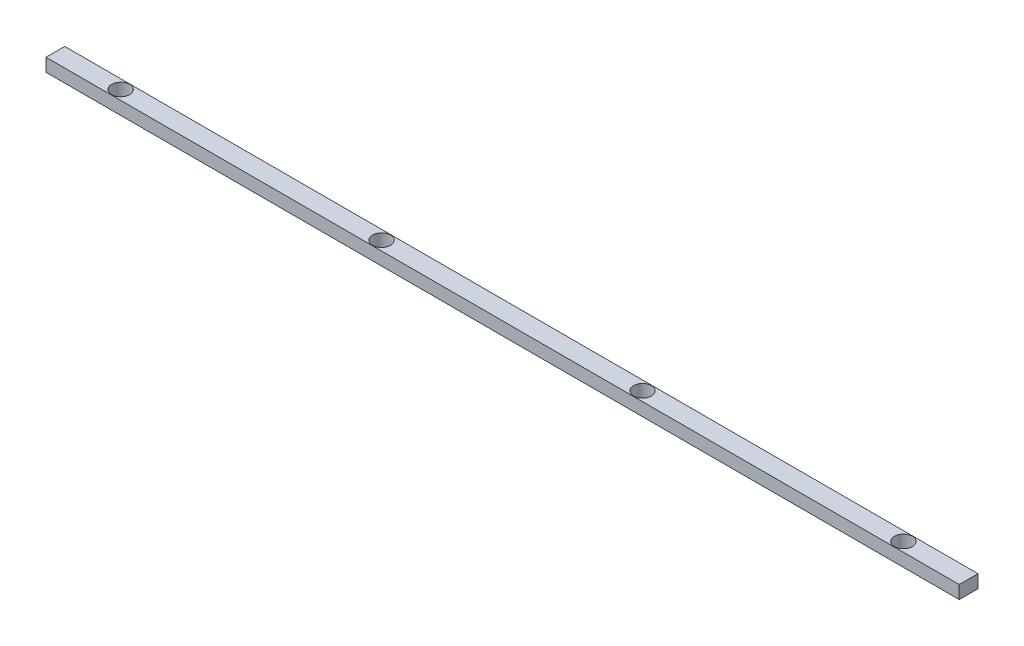
ISO-10303-21;
HEADER;
FILE_DESCRIPTION(('STEP AP214'),'2;1');
FILE_NAME('part.step','',(''),(''),'','','');
FILE_SCHEMA(('AUTOMOTIVE_DESIGN { 1 0 10303 214 1 1 1 1 }'));
ENDSEC;
DATA;
#1=APPLICATION_CONTEXT('core data for automotive mechanical design processes');
#2=APPLICATION_PROTOCOL_DEFINITION('international standard','automotive_design',2000,#1);
#3=PRODUCT_CONTEXT('',#1,'mechanical');
#4=PRODUCT('Part','Part','',(#3));
#5=PRODUCT_RELATED_PRODUCT_CATEGORY('part','',(#4));
#6=PRODUCT_DEFINITION_FORMATION('','',#4);
#7=PRODUCT_DEFINITION_CONTEXT('part definition',#1,'design');
#8=PRODUCT_DEFINITION('design','',#6,#7);
#9=PRODUCT_DEFINITION_SHAPE('','',#8);
#10=(LENGTH_UNIT() NAMED_UNIT(*) SI_UNIT(.MILLI.,.METRE.));
#11=(NAMED_UNIT(*) PLANE_ANGLE_UNIT() SI_UNIT($,.RADIAN.));
#12=(NAMED_UNIT(*) SI_UNIT($,.STERADIAN.) SOLID_ANGLE_UNIT());
#13=UNCERTAINTY_MEASURE_WITH_UNIT(LENGTH_MEASURE(1.E-05),#10,'distance_accuracy_value','');
#14=(GEOMETRIC_REPRESENTATION_CONTEXT(3) GLOBAL_UNCERTAINTY_ASSIGNED_CONTEXT((#13)) GLOBAL_UNIT_ASSIGNED_CONTEXT((#10,
#11,#12)) REPRESENTATION_CONTEXT('',''));
#15=CARTESIAN_POINT('',(0.,0.,0.));
#16=DIRECTION('',(0.,0.,1.));
#17=DIRECTION('',(1.,0.,0.));
#18=AXIS2_PLACEMENT_3D('',#15,#16,#17);
#19=CARTESIAN_POINT('',(177.799999999999,5.08,3.65124999999998));
#20=DIRECTION('',(-1.,0.,0.));
#21=DIRECTION('',(0.,0.,1.));
#22=AXIS2_PLACEMENT_3D('',#19,#20,#21);
#23=PLANE('',#22);
#24=DIRECTION('',(0.,0.,-1.));
#25=VECTOR('',#24,1.);
#26=CARTESIAN_POINT('',(177.799999999999,0.,3.65124999999998));
#27=LINE('',#26,#25);
#28=CARTESIAN_POINT('',(177.799999999999,0.,3.65124999999998));
#29=VERTEX_POINT('',#28);
#30=CARTESIAN_POINT('',(177.799999999999,0.,-3.65125000000004));
#31=VERTEX_POINT('',#30);
#32=EDGE_CURVE('E96',#29,#31,#27,.T.);
#33=ORIENTED_EDGE('',*,*,#32,.T.);
#34=DIRECTION('',(0.,-1.,0.));
#35=VECTOR('',#34,1.);
#36=CARTESIAN_POINT('',(177.799999999999,5.08,-3.65125000000004));
#37=LINE('',#36,#35);
#38=CARTESIAN_POINT('',(177.799999999999,5.08,-3.65125000000004));
#39=VERTEX_POINT('',#38);
#40=EDGE_CURVE('E11',#39,#31,#37,.T.);
#41=ORIENTED_EDGE('',*,*,#40,.F.);
#42=DIRECTION('',(0.,0.,-1.));
#43=VECTOR('',#42,1.);
#44=CARTESIAN_POINT('',(177.799999999999,5.08,3.65124999999998));
#45=LINE('',#44,#43);
#46=CARTESIAN_POINT('',(177.799999999999,5.08,3.65124999999998));
#47=VERTEX_POINT('',#46);
#48=EDGE_CURVE('E84',#47,#39,#45,.T.);
#49=ORIENTED_EDGE('',*,*,#48,.F.);
#50=DIRECTION('',(0.,-1.,0.));
#51=VECTOR('',#50,1.);
#52=CARTESIAN_POINT('',(177.799999999999,5.08,3.65124999999998));
#53=LINE('',#52,#51);
#54=EDGE_CURVE('E92',#47,#29,#53,.T.);
#55=ORIENTED_EDGE('',*,*,#54,.T.);
#56=EDGE_LOOP('',(#33,#41,#49,#55));
#57=FACE_BOUND('',#56,.T.);
#58=ADVANCED_FACE('F33',(#57),#23,.F.);
#59=CARTESIAN_POINT('',(-177.800000000001,5.08,-3.65125000000004));
#60=DIRECTION('',(0.,0.,1.));
#61=DIRECTION('',(1.,0.,0.));
#62=AXIS2_PLACEMENT_3D('',#59,#60,#61);
#63=PLANE('',#62);
#64=DIRECTION('',(-1.,0.,0.));
#65=VECTOR('',#64,1.);
#66=CARTESIAN_POINT('',(-177.800000000001,0.,-3.65125000000004));
#67=LINE('',#66,#65);
#68=CARTESIAN_POINT('',(-177.800000000001,0.,-3.65125000000004));
#69=VERTEX_POINT('',#68);
#70=EDGE_CURVE('E88',#31,#69,#67,.T.);
#71=ORIENTED_EDGE('',*,*,#70,.T.);
#72=DIRECTION('',(0.,-1.,0.));
#73=VECTOR('',#72,1.);
#74=CARTESIAN_POINT('',(-177.800000000001,5.08,-3.65125000000004));
#75=LINE('',#74,#73);
#76=CARTESIAN_POINT('',(-177.800000000001,5.08,-3.65125000000004));
#77=VERTEX_POINT('',#76);
#78=EDGE_CURVE('E41',#77,#69,#75,.T.);
#79=ORIENTED_EDGE('',*,*,#78,.F.);
#80=DIRECTION('',(-1.,0.,0.));
#81=VECTOR('',#80,1.);
#82=CARTESIAN_POINT('',(-177.800000000001,5.08,-3.65125000000004));
#83=LINE('',#82,#81);
#84=EDGE_CURVE('E79',#39,#77,#83,.T.);
#85=ORIENTED_EDGE('',*,*,#84,.F.);
#86=ORIENTED_EDGE('',*,*,#40,.T.);
#87=EDGE_LOOP('',(#71,#79,#85,#86));
#88=FACE_BOUND('',#87,.T.);
#89=ADVANCED_FACE('F87',(#88),#63,.F.);
#90=CARTESIAN_POINT('',(-177.800000000001,5.08,3.65124999999998));
#91=DIRECTION('',(1.,0.,0.));
#92=DIRECTION('',(0.,0.,-1.));
#93=AXIS2_PLACEMENT_3D('',#90,#91,#92);
#94=PLANE('',#93);
#95=DIRECTION('',(0.,0.,1.));
#96=VECTOR('',#95,1.);
#97=CARTESIAN_POINT('',(-177.800000000001,0.,3.65124999999998));
#98=LINE('',#97,#96);
#99=CARTESIAN_POINT('',(-177.800000000001,0.,3.65124999999998));
#100=VERTEX_POINT('',#99);
#101=EDGE_CURVE('E66',#69,#100,#98,.T.);
#102=ORIENTED_EDGE('',*,*,#101,.T.);
#103=DIRECTION('',(0.,-1.,0.));
#104=VECTOR('',#103,1.);
#105=CARTESIAN_POINT('',(-177.800000000001,5.08,3.65124999999998));
#106=LINE('',#105,#104);
#107=CARTESIAN_POINT('',(-177.800000000001,5.08,3.65124999999998));
#108=VERTEX_POINT('',#107);
#109=EDGE_CURVE('E89',#108,#100,#106,.T.);
#110=ORIENTED_EDGE('',*,*,#109,.F.);
#111=DIRECTION('',(0.,0.,1.));
#112=VECTOR('',#111,1.);
#113=CARTESIAN_POINT('',(-177.800000000001,5.08,3.65124999999998));
#114=LINE('',#113,#112);
#115=EDGE_CURVE('E82',#77,#108,#114,.T.);
#116=ORIENTED_EDGE('',*,*,#115,.F.);
#117=ORIENTED_EDGE('',*,*,#78,.T.);
#118=EDGE_LOOP('',(#102,#110,#116,#117));
#119=FACE_BOUND('',#118,.T.);
#120=ADVANCED_FACE('F90',(#119),#94,.F.);
#121=CARTESIAN_POINT('',(-177.800000000001,5.08,3.65124999999998));
#122=DIRECTION('',(0.,0.,-1.));
#123=DIRECTION('',(-1.,0.,0.));
#124=AXIS2_PLACEMENT_3D('',#121,#122,#123);
#125=PLANE('',#124);
#126=DIRECTION('',(1.,0.,0.));
#127=VECTOR('',#126,1.);
#128=CARTESIAN_POINT('',(-177.800000000001,0.,3.65124999999998));
#129=LINE('',#128,#127);
#130=EDGE_CURVE('E72',#100,#29,#129,.T.);
#131=ORIENTED_EDGE('',*,*,#130,.T.);
#132=ORIENTED_EDGE('',*,*,#54,.F.);
#133=DIRECTION('',(1.,0.,0.));
#134=VECTOR('',#133,1.);
#135=CARTESIAN_POINT('',(-177.800000000001,5.08,3.65124999999998));
#136=LINE('',#135,#134);
#137=EDGE_CURVE('E49',#108,#47,#136,.T.);
#138=ORIENTED_EDGE('',*,*,#137,.F.);
#139=ORIENTED_EDGE('',*,*,#109,.T.);
#140=EDGE_LOOP('',(#131,#132,#138,#139));
#141=FACE_BOUND('',#140,.T.);
#142=ADVANCED_FACE('F104',(#141),#125,.F.);
#143=CARTESIAN_POINT('',(0.,5.08,0.));
#144=DIRECTION('',(0.,-1.,0.));
#145=DIRECTION('',(0.,0.,-1.));
#146=AXIS2_PLACEMENT_3D('',#143,#144,#145);
#147=PLANE('',#146);
#148=CARTESIAN_POINT('',(152.399999999999,5.08,0.));
#149=DIRECTION('',(0.,1.,0.));
#150=DIRECTION('',(0.,0.,1.));
#151=AXIS2_PLACEMENT_3D('',#148,#149,#150);
#152=CIRCLE('',#151,3.49250000000001);
#153=CARTESIAN_POINT('',(152.399999999999,5.08,3.49250000000001));
#154=VERTEX_POINT('',#153);
#155=EDGE_CURVE('E128',#154,#154,#152,.T.);
#156=ORIENTED_EDGE('',*,*,#155,.F.);
#157=EDGE_LOOP('',(#156));
#158=FACE_BOUND('',#157,.T.);
#159=CARTESIAN_POINT('',(50.7999999999987,5.08,0.));
#160=DIRECTION('',(0.,1.,0.));
#161=DIRECTION('',(0.,0.,1.));
#162=AXIS2_PLACEMENT_3D('',#159,#160,#161);
#163=CIRCLE('',#162,3.49250000000001);
#164=CARTESIAN_POINT('',(50.7999999999987,5.08,3.49250000000001));
#165=VERTEX_POINT('',#164);
#166=EDGE_CURVE('E122',#165,#165,#163,.T.);
#167=ORIENTED_EDGE('',*,*,#166,.F.);
#168=EDGE_LOOP('',(#167));
#169=FACE_BOUND('',#168,.T.);
#170=CARTESIAN_POINT('',(-50.8000000000013,5.08,0.));
#171=DIRECTION('',(0.,1.,0.));
#172=DIRECTION('',(0.,0.,1.));
#173=AXIS2_PLACEMENT_3D('',#170,#171,#172);
#174=CIRCLE('',#173,3.49250000000001);
#175=CARTESIAN_POINT('',(-50.8000000000013,5.08,3.49250000000001));
#176=VERTEX_POINT('',#175);
#177=EDGE_CURVE('E116',#176,#176,#174,.T.);
#178=ORIENTED_EDGE('',*,*,#177,.F.);
#179=EDGE_LOOP('',(#178));
#180=FACE_BOUND('',#179,.T.);
#181=CARTESIAN_POINT('',(-152.400000000001,5.08,0.));
#182=DIRECTION('',(0.,1.,0.));
#183=DIRECTION('',(0.,0.,1.));
#184=AXIS2_PLACEMENT_3D('',#181,#182,#183);
#185=CIRCLE('',#184,3.49250000000001);
#186=CARTESIAN_POINT('',(-152.400000000001,5.08,3.49250000000001));
#187=VERTEX_POINT('',#186);
#188=EDGE_CURVE('E110',#187,#187,#185,.T.);
#189=ORIENTED_EDGE('',*,*,#188,.F.);
#190=EDGE_LOOP('',(#189));
#191=FACE_BOUND('',#190,.T.);
#192=ORIENTED_EDGE('',*,*,#48,.T.);
#193=ORIENTED_EDGE('',*,*,#84,.T.);
#194=ORIENTED_EDGE('',*,*,#115,.T.);
#195=ORIENTED_EDGE('',*,*,#137,.T.);
#196=EDGE_LOOP('',(#192,#193,#194,#195));
#197=FACE_BOUND('',#196,.T.);
#198=ADVANCED_FACE('F80',(#158,#169,#180,#191,#197),#147,.F.);
#199=CARTESIAN_POINT('',(0.,0.,0.));
#200=DIRECTION('',(0.,-1.,0.));
#201=DIRECTION('',(0.,0.,-1.));
#202=AXIS2_PLACEMENT_3D('',#199,#200,#201);
#203=PLANE('',#202);
#204=CARTESIAN_POINT('',(152.399999999999,0.,0.));
#205=DIRECTION('',(0.,1.,0.));
#206=DIRECTION('',(0.,0.,1.));
#207=AXIS2_PLACEMENT_3D('',#204,#205,#206);
#208=CIRCLE('',#207,3.49250000000001);
#209=CARTESIAN_POINT('',(152.399999999999,0.,3.49250000000001));
#210=VERTEX_POINT('',#209);
#211=EDGE_CURVE('E125',#210,#210,#208,.T.);
#212=ORIENTED_EDGE('',*,*,#211,.T.);
#213=EDGE_LOOP('',(#212));
#214=FACE_BOUND('',#213,.T.);
#215=CARTESIAN_POINT('',(50.7999999999987,0.,0.));
#216=DIRECTION('',(0.,1.,0.));
#217=DIRECTION('',(0.,0.,1.));
#218=AXIS2_PLACEMENT_3D('',#215,#216,#217);
#219=CIRCLE('',#218,3.49250000000001);
#220=CARTESIAN_POINT('',(50.7999999999987,0.,3.49250000000001));
#221=VERTEX_POINT('',#220);
#222=EDGE_CURVE('E119',#221,#221,#219,.T.);
#223=ORIENTED_EDGE('',*,*,#222,.T.);
#224=EDGE_LOOP('',(#223));
#225=FACE_BOUND('',#224,.T.);
#226=CARTESIAN_POINT('',(-50.8000000000013,0.,0.));
#227=DIRECTION('',(0.,1.,0.));
#228=DIRECTION('',(0.,0.,1.));
#229=AXIS2_PLACEMENT_3D('',#226,#227,#228);
#230=CIRCLE('',#229,3.49250000000001);
#231=CARTESIAN_POINT('',(-50.8000000000013,0.,3.49250000000001));
#232=VERTEX_POINT('',#231);
#233=EDGE_CURVE('E113',#232,#232,#230,.T.);
#234=ORIENTED_EDGE('',*,*,#233,.T.);
#235=EDGE_LOOP('',(#234));
#236=FACE_BOUND('',#235,.T.);
#237=CARTESIAN_POINT('',(-152.400000000001,0.,0.));
#238=DIRECTION('',(0.,1.,0.));
#239=DIRECTION('',(0.,0.,1.));
#240=AXIS2_PLACEMENT_3D('',#237,#238,#239);
#241=CIRCLE('',#240,3.49250000000001);
#242=CARTESIAN_POINT('',(-152.400000000001,0.,3.49250000000001));
#243=VERTEX_POINT('',#242);
#244=EDGE_CURVE('E99',#243,#243,#241,.T.);
#245=ORIENTED_EDGE('',*,*,#244,.T.);
#246=EDGE_LOOP('',(#245));
#247=FACE_BOUND('',#246,.T.);
#248=ORIENTED_EDGE('',*,*,#32,.F.);
#249=ORIENTED_EDGE('',*,*,#130,.F.);
#250=ORIENTED_EDGE('',*,*,#101,.F.);
#251=ORIENTED_EDGE('',*,*,#70,.F.);
#252=EDGE_LOOP('',(#248,#249,#250,#251));
#253=FACE_BOUND('',#252,.T.);
#254=ADVANCED_FACE('F107',(#214,#225,#236,#247,#253),#203,.T.);
#255=CARTESIAN_POINT('',(-152.400000000001,0.,0.));
#256=DIRECTION('',(0.,1.,0.));
#257=DIRECTION('',(0.,0.,1.));
#258=AXIS2_PLACEMENT_3D('',#255,#256,#257);
#259=CYLINDRICAL_SURFACE('',#258,3.49250000000001);
#260=ORIENTED_EDGE('',*,*,#244,.F.);
#261=EDGE_LOOP('',(#260));
#262=FACE_BOUND('',#261,.T.);
#263=ORIENTED_EDGE('',*,*,#188,.T.);
#264=EDGE_LOOP('',(#263));
#265=FACE_BOUND('',#264,.T.);
#266=ADVANCED_FACE('F152',(#262,#265),#259,.F.);
#267=CARTESIAN_POINT('',(-50.8000000000013,0.,0.));
#268=DIRECTION('',(0.,1.,0.));
#269=DIRECTION('',(0.,0.,1.));
#270=AXIS2_PLACEMENT_3D('',#267,#268,#269);
#271=CYLINDRICAL_SURFACE('',#270,3.49250000000001);
#272=ORIENTED_EDGE('',*,*,#233,.F.);
#273=EDGE_LOOP('',(#272));
#274=FACE_BOUND('',#273,.T.);
#275=ORIENTED_EDGE('',*,*,#177,.T.);
#276=EDGE_LOOP('',(#275));
#277=FACE_BOUND('',#276,.T.);
#278=ADVANCED_FACE('F154',(#274,#277),#271,.F.);
#279=CARTESIAN_POINT('',(50.7999999999987,0.,0.));
#280=DIRECTION('',(0.,1.,0.));
#281=DIRECTION('',(0.,0.,1.));
#282=AXIS2_PLACEMENT_3D('',#279,#280,#281);
#283=CYLINDRICAL_SURFACE('',#282,3.49250000000001);
#284=ORIENTED_EDGE('',*,*,#222,.F.);
#285=EDGE_LOOP('',(#284));
#286=FACE_BOUND('',#285,.T.);
#287=ORIENTED_EDGE('',*,*,#166,.T.);
#288=EDGE_LOOP('',(#287));
#289=FACE_BOUND('',#288,.T.);
#290=ADVANCED_FACE('F139',(#286,#289),#283,.F.);
#291=CARTESIAN_POINT('',(152.399999999999,0.,0.));
#292=DIRECTION('',(0.,1.,0.));
#293=DIRECTION('',(0.,0.,1.));
#294=AXIS2_PLACEMENT_3D('',#291,#292,#293);
#295=CYLINDRICAL_SURFACE('',#294,3.49250000000001);
#296=ORIENTED_EDGE('',*,*,#211,.F.);
#297=EDGE_LOOP('',(#296));
#298=FACE_BOUND('',#297,.T.);
#299=ORIENTED_EDGE('',*,*,#155,.T.);
#300=EDGE_LOOP('',(#299));
#301=FACE_BOUND('',#300,.T.);
#302=ADVANCED_FACE('F136',(#298,#301),#295,.F.);
#303=CLOSED_SHELL('',(#58,#89,#120,#142,#198,#254,#266,#278,#290,#302));
#304=MANIFOLD_SOLID_BREP('B2',#303);
#305=ADVANCED_BREP_SHAPE_REPRESENTATION('',(#18,#304),#14);
#306=SHAPE_DEFINITION_REPRESENTATION(#9,#305);
ENDSEC;
END-ISO-10303-21;
